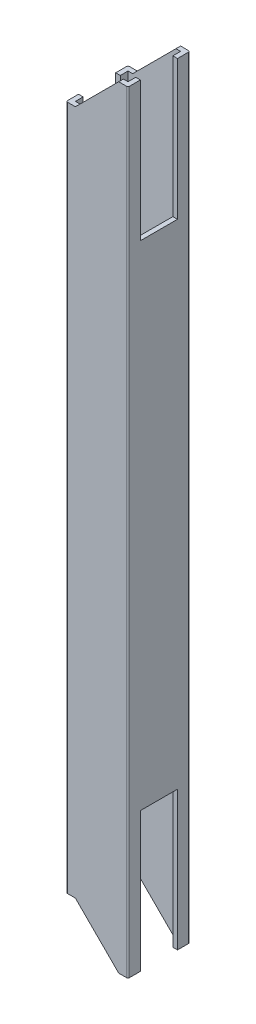
ISO-10303-21;
HEADER;
FILE_DESCRIPTION(('STEP AP214'),'2;1');
FILE_NAME('part.step','',(''),(''),'','','');
FILE_SCHEMA(('AUTOMOTIVE_DESIGN { 1 0 10303 214 1 1 1 1 }'));
ENDSEC;
DATA;
#1=APPLICATION_CONTEXT('core data for automotive mechanical design processes');
#2=APPLICATION_PROTOCOL_DEFINITION('international standard','automotive_design',2000,#1);
#3=PRODUCT_CONTEXT('',#1,'mechanical');
#4=PRODUCT('Part','Part','',(#3));
#5=PRODUCT_RELATED_PRODUCT_CATEGORY('part','',(#4));
#6=PRODUCT_DEFINITION_FORMATION('','',#4);
#7=PRODUCT_DEFINITION_CONTEXT('part definition',#1,'design');
#8=PRODUCT_DEFINITION('design','',#6,#7);
#9=PRODUCT_DEFINITION_SHAPE('','',#8);
#10=(LENGTH_UNIT() NAMED_UNIT(*) SI_UNIT(.MILLI.,.METRE.));
#11=(NAMED_UNIT(*) PLANE_ANGLE_UNIT() SI_UNIT($,.RADIAN.));
#12=(NAMED_UNIT(*) SI_UNIT($,.STERADIAN.) SOLID_ANGLE_UNIT());
#13=UNCERTAINTY_MEASURE_WITH_UNIT(LENGTH_MEASURE(1.E-05),#10,'distance_accuracy_value','');
#14=(GEOMETRIC_REPRESENTATION_CONTEXT(3) GLOBAL_UNCERTAINTY_ASSIGNED_CONTEXT((#13)) GLOBAL_UNIT_ASSIGNED_CONTEXT((#10,
#11,#12)) REPRESENTATION_CONTEXT('',''));
#15=CARTESIAN_POINT('',(0.,0.,0.));
#16=DIRECTION('',(0.,0.,1.));
#17=DIRECTION('',(1.,0.,0.));
#18=AXIS2_PLACEMENT_3D('',#15,#16,#17);
#19=CARTESIAN_POINT('',(19.5,249.5,-0.5));
#20=DIRECTION('',(0.,1.,0.));
#21=DIRECTION('',(0.,0.,1.));
#22=AXIS2_PLACEMENT_3D('',#19,#20,#21);
#23=PLANE('',#22);
#24=DIRECTION('',(0.,0.,-1.));
#25=VECTOR('',#24,1.);
#26=CARTESIAN_POINT('',(17.,249.5,0.));
#27=LINE('',#26,#25);
#28=CARTESIAN_POINT('',(17.,249.5,0.));
#29=VERTEX_POINT('',#28);
#30=CARTESIAN_POINT('',(17.,249.5,-1.5));
#31=VERTEX_POINT('',#30);
#32=EDGE_CURVE('E267',#29,#31,#27,.T.);
#33=ORIENTED_EDGE('',*,*,#32,.F.);
#34=DIRECTION('',(1.,0.,0.));
#35=VECTOR('',#34,1.);
#36=CARTESIAN_POINT('',(0.500000000000004,249.5,0.));
#37=LINE('',#36,#35);
#38=CARTESIAN_POINT('',(19.5,249.5,0.));
#39=VERTEX_POINT('',#38);
#40=EDGE_CURVE('E281',#29,#39,#37,.T.);
#41=ORIENTED_EDGE('',*,*,#40,.T.);
#42=CARTESIAN_POINT('',(19.5,249.5,-0.5));
#43=DIRECTION('',(0.,1.,0.));
#44=DIRECTION('',(0.,0.,1.));
#45=AXIS2_PLACEMENT_3D('',#42,#43,#44);
#46=CIRCLE('',#45,0.5);
#47=CARTESIAN_POINT('',(20.,249.5,-0.5));
#48=VERTEX_POINT('',#47);
#49=EDGE_CURVE('E315',#39,#48,#46,.T.);
#50=ORIENTED_EDGE('',*,*,#49,.T.);
#51=DIRECTION('',(0.,0.,-1.));
#52=VECTOR('',#51,1.);
#53=CARTESIAN_POINT('',(20.,249.5,-0.5));
#54=LINE('',#53,#52);
#55=CARTESIAN_POINT('',(20.,249.5,-4.00000000000007));
#56=VERTEX_POINT('',#55);
#57=EDGE_CURVE('E515',#48,#56,#54,.T.);
#58=ORIENTED_EDGE('',*,*,#57,.T.);
#59=DIRECTION('',(-1.,0.,0.));
#60=VECTOR('',#59,1.);
#61=CARTESIAN_POINT('',(20.,249.5,-4.00000000000007));
#62=LINE('',#61,#60);
#63=CARTESIAN_POINT('',(18.5,249.5,-4.00000000000007));
#64=VERTEX_POINT('',#63);
#65=EDGE_CURVE('E428',#56,#64,#62,.T.);
#66=ORIENTED_EDGE('',*,*,#65,.T.);
#67=DIRECTION('',(0.,0.,-1.));
#68=VECTOR('',#67,1.);
#69=CARTESIAN_POINT('',(18.5,249.5,-1.5));
#70=LINE('',#69,#68);
#71=CARTESIAN_POINT('',(18.5,249.5,-1.5));
#72=VERTEX_POINT('',#71);
#73=EDGE_CURVE('E492',#72,#64,#70,.T.);
#74=ORIENTED_EDGE('',*,*,#73,.F.);
#75=DIRECTION('',(1.,0.,0.));
#76=VECTOR('',#75,1.);
#77=CARTESIAN_POINT('',(1.5,249.5,-1.5));
#78=LINE('',#77,#76);
#79=EDGE_CURVE('E284',#31,#72,#78,.T.);
#80=ORIENTED_EDGE('',*,*,#79,.F.);
#81=EDGE_LOOP('',(#33,#41,#50,#58,#66,#74,#80));
#82=FACE_BOUND('',#81,.T.);
#83=ADVANCED_FACE('F33',(#82),#23,.T.);
#84=CARTESIAN_POINT('',(19.5,0.,-0.5));
#85=DIRECTION('',(0.,1.,0.));
#86=DIRECTION('',(0.,0.,1.));
#87=AXIS2_PLACEMENT_3D('',#84,#85,#86);
#88=PLANE('',#87);
#89=DIRECTION('',(-1.,0.,0.));
#90=VECTOR('',#89,1.);
#91=CARTESIAN_POINT('',(1.5,0.,-18.5));
#92=LINE('',#91,#90);
#93=CARTESIAN_POINT('',(18.5,0.,-18.5));
#94=VERTEX_POINT('',#93);
#95=CARTESIAN_POINT('',(17.,0.,-18.5));
#96=VERTEX_POINT('',#95);
#97=EDGE_CURVE('E491',#94,#96,#92,.T.);
#98=ORIENTED_EDGE('',*,*,#97,.T.);
#99=DIRECTION('',(0.,0.,-1.));
#100=VECTOR('',#99,1.);
#101=CARTESIAN_POINT('',(17.,0.,0.));
#102=LINE('',#101,#100);
#103=CARTESIAN_POINT('',(17.,0.,-20.));
#104=VERTEX_POINT('',#103);
#105=EDGE_CURVE('E360',#96,#104,#102,.T.);
#106=ORIENTED_EDGE('',*,*,#105,.T.);
#107=DIRECTION('',(-1.,0.,0.));
#108=VECTOR('',#107,1.);
#109=CARTESIAN_POINT('',(0.5,0.,-20.));
#110=LINE('',#109,#108);
#111=CARTESIAN_POINT('',(19.5,0.,-20.));
#112=VERTEX_POINT('',#111);
#113=EDGE_CURVE('E311',#112,#104,#110,.T.);
#114=ORIENTED_EDGE('',*,*,#113,.F.);
#115=CARTESIAN_POINT('',(19.5,0.,-19.5));
#116=DIRECTION('',(0.,1.,0.));
#117=DIRECTION('',(0.,0.,-1.));
#118=AXIS2_PLACEMENT_3D('',#115,#116,#117);
#119=CIRCLE('',#118,0.5);
#120=CARTESIAN_POINT('',(20.,0.,-19.5));
#121=VERTEX_POINT('',#120);
#122=EDGE_CURVE('E309',#121,#112,#119,.T.);
#123=ORIENTED_EDGE('',*,*,#122,.F.);
#124=DIRECTION('',(0.,0.,-1.));
#125=VECTOR('',#124,1.);
#126=CARTESIAN_POINT('',(20.,0.,-0.5));
#127=LINE('',#126,#125);
#128=CARTESIAN_POINT('',(20.,0.,-16.));
#129=VERTEX_POINT('',#128);
#130=EDGE_CURVE('E304',#129,#121,#127,.T.);
#131=ORIENTED_EDGE('',*,*,#130,.F.);
#132=DIRECTION('',(-1.,0.,0.));
#133=VECTOR('',#132,1.);
#134=CARTESIAN_POINT('',(20.,0.,-16.));
#135=LINE('',#134,#133);
#136=CARTESIAN_POINT('',(18.5,0.,-16.));
#137=VERTEX_POINT('',#136);
#138=EDGE_CURVE('E423',#129,#137,#135,.T.);
#139=ORIENTED_EDGE('',*,*,#138,.T.);
#140=DIRECTION('',(0.,0.,-1.));
#141=VECTOR('',#140,1.);
#142=CARTESIAN_POINT('',(18.5,0.,-1.5));
#143=LINE('',#142,#141);
#144=EDGE_CURVE('E499',#137,#94,#143,.T.);
#145=ORIENTED_EDGE('',*,*,#144,.T.);
#146=EDGE_LOOP('',(#98,#106,#114,#123,#131,#139,#145));
#147=FACE_BOUND('',#146,.T.);
#148=ADVANCED_FACE('F587',(#147),#88,.F.);
#149=CARTESIAN_POINT('',(17.,249.5,-18.5));
#150=VERTEX_POINT('',#149);
#151=CARTESIAN_POINT('',(17.,249.5,-20.));
#152=VERTEX_POINT('',#151);
#153=EDGE_CURVE('E286',#150,#152,#27,.T.);
#154=ORIENTED_EDGE('',*,*,#153,.F.);
#155=DIRECTION('',(-1.,0.,0.));
#156=VECTOR('',#155,1.);
#157=CARTESIAN_POINT('',(1.5,249.5,-18.5));
#158=LINE('',#157,#156);
#159=CARTESIAN_POINT('',(18.5,249.5,-18.5));
#160=VERTEX_POINT('',#159);
#161=EDGE_CURVE('E495',#160,#150,#158,.T.);
#162=ORIENTED_EDGE('',*,*,#161,.F.);
#163=CARTESIAN_POINT('',(18.5,249.5,-16.0000000000001));
#164=VERTEX_POINT('',#163);
#165=EDGE_CURVE('E490',#164,#160,#70,.T.);
#166=ORIENTED_EDGE('',*,*,#165,.F.);
#167=DIRECTION('',(-1.,0.,0.));
#168=VECTOR('',#167,1.);
#169=CARTESIAN_POINT('',(20.,249.5,-16.));
#170=LINE('',#169,#168);
#171=CARTESIAN_POINT('',(20.,249.5,-16.));
#172=VERTEX_POINT('',#171);
#173=EDGE_CURVE('E455',#172,#164,#170,.T.);
#174=ORIENTED_EDGE('',*,*,#173,.F.);
#175=CARTESIAN_POINT('',(20.,249.5,-19.5));
#176=VERTEX_POINT('',#175);
#177=EDGE_CURVE('E514',#172,#176,#54,.T.);
#178=ORIENTED_EDGE('',*,*,#177,.T.);
#179=CARTESIAN_POINT('',(19.5,249.5,-19.5));
#180=DIRECTION('',(0.,1.,0.));
#181=DIRECTION('',(0.,0.,-1.));
#182=AXIS2_PLACEMENT_3D('',#179,#180,#181);
#183=CIRCLE('',#182,0.5);
#184=CARTESIAN_POINT('',(19.5,249.5,-20.));
#185=VERTEX_POINT('',#184);
#186=EDGE_CURVE('E297',#176,#185,#183,.T.);
#187=ORIENTED_EDGE('',*,*,#186,.T.);
#188=DIRECTION('',(-1.,0.,0.));
#189=VECTOR('',#188,1.);
#190=CARTESIAN_POINT('',(0.5,249.5,-20.));
#191=LINE('',#190,#189);
#192=EDGE_CURVE('E292',#185,#152,#191,.T.);
#193=ORIENTED_EDGE('',*,*,#192,.T.);
#194=EDGE_LOOP('',(#154,#162,#166,#174,#178,#187,#193));
#195=FACE_BOUND('',#194,.T.);
#196=ADVANCED_FACE('F521',(#195),#23,.T.);
#197=DIRECTION('',(1.,0.,0.));
#198=VECTOR('',#197,1.);
#199=CARTESIAN_POINT('',(0.500000000000004,0.,0.));
#200=LINE('',#199,#198);
#201=CARTESIAN_POINT('',(17.,0.,0.));
#202=VERTEX_POINT('',#201);
#203=CARTESIAN_POINT('',(19.5,0.,0.));
#204=VERTEX_POINT('',#203);
#205=EDGE_CURVE('E314',#202,#204,#200,.T.);
#206=ORIENTED_EDGE('',*,*,#205,.F.);
#207=CARTESIAN_POINT('',(17.,0.,-1.5));
#208=VERTEX_POINT('',#207);
#209=EDGE_CURVE('E558',#202,#208,#102,.T.);
#210=ORIENTED_EDGE('',*,*,#209,.T.);
#211=DIRECTION('',(1.,0.,0.));
#212=VECTOR('',#211,1.);
#213=CARTESIAN_POINT('',(1.5,0.,-1.5));
#214=LINE('',#213,#212);
#215=CARTESIAN_POINT('',(18.5,0.,-1.5));
#216=VERTEX_POINT('',#215);
#217=EDGE_CURVE('E488',#208,#216,#214,.T.);
#218=ORIENTED_EDGE('',*,*,#217,.T.);
#219=CARTESIAN_POINT('',(18.5,0.,-4.));
#220=VERTEX_POINT('',#219);
#221=EDGE_CURVE('E500',#216,#220,#143,.T.);
#222=ORIENTED_EDGE('',*,*,#221,.T.);
#223=DIRECTION('',(-1.,0.,0.));
#224=VECTOR('',#223,1.);
#225=CARTESIAN_POINT('',(20.,0.,-4.));
#226=LINE('',#225,#224);
#227=CARTESIAN_POINT('',(20.,0.,-4.));
#228=VERTEX_POINT('',#227);
#229=EDGE_CURVE('E441',#228,#220,#226,.T.);
#230=ORIENTED_EDGE('',*,*,#229,.F.);
#231=CARTESIAN_POINT('',(20.,0.,-0.5));
#232=VERTEX_POINT('',#231);
#233=EDGE_CURVE('E306',#232,#228,#127,.T.);
#234=ORIENTED_EDGE('',*,*,#233,.F.);
#235=CARTESIAN_POINT('',(19.5,0.,-0.5));
#236=DIRECTION('',(0.,1.,0.));
#237=DIRECTION('',(0.,0.,1.));
#238=AXIS2_PLACEMENT_3D('',#235,#236,#237);
#239=CIRCLE('',#238,0.5);
#240=EDGE_CURVE('E301',#204,#232,#239,.T.);
#241=ORIENTED_EDGE('',*,*,#240,.F.);
#242=EDGE_LOOP('',(#206,#210,#218,#222,#230,#234,#241));
#243=FACE_BOUND('',#242,.T.);
#244=ADVANCED_FACE('F614',(#243),#88,.F.);
#245=CARTESIAN_POINT('',(19.5,249.5,-0.5));
#246=DIRECTION('',(0.,-1.,0.));
#247=DIRECTION('',(0.,0.,-1.));
#248=AXIS2_PLACEMENT_3D('',#245,#246,#247);
#249=CYLINDRICAL_SURFACE('',#248,0.5);
#250=ORIENTED_EDGE('',*,*,#240,.T.);
#251=DIRECTION('',(0.,-1.,0.));
#252=VECTOR('',#251,1.);
#253=CARTESIAN_POINT('',(20.,249.5,-0.5));
#254=LINE('',#253,#252);
#255=EDGE_CURVE('E334',#48,#232,#254,.T.);
#256=ORIENTED_EDGE('',*,*,#255,.F.);
#257=ORIENTED_EDGE('',*,*,#49,.F.);
#258=DIRECTION('',(0.,-1.,0.));
#259=VECTOR('',#258,1.);
#260=CARTESIAN_POINT('',(19.5,249.5,0.));
#261=LINE('',#260,#259);
#262=EDGE_CURVE('E290',#39,#204,#261,.T.);
#263=ORIENTED_EDGE('',*,*,#262,.T.);
#264=EDGE_LOOP('',(#250,#256,#257,#263));
#265=FACE_BOUND('',#264,.T.);
#266=ADVANCED_FACE('F35',(#265),#249,.T.);
#267=CARTESIAN_POINT('',(20.,249.5,-0.5));
#268=DIRECTION('',(-1.,0.,0.));
#269=DIRECTION('',(0.,0.,1.));
#270=AXIS2_PLACEMENT_3D('',#267,#268,#269);
#271=PLANE('',#270);
#272=DIRECTION('',(0.,0.,-1.));
#273=VECTOR('',#272,1.);
#274=CARTESIAN_POINT('',(20.,45.,-16.));
#275=LINE('',#274,#273);
#276=CARTESIAN_POINT('',(20.,45.,-3.99999999999995));
#277=VERTEX_POINT('',#276);
#278=CARTESIAN_POINT('',(20.,45.,-16.));
#279=VERTEX_POINT('',#278);
#280=EDGE_CURVE('E420',#277,#279,#275,.T.);
#281=ORIENTED_EDGE('',*,*,#280,.T.);
#282=DIRECTION('',(0.,-1.,0.));
#283=VECTOR('',#282,1.);
#284=CARTESIAN_POINT('',(20.,0.,-16.));
#285=LINE('',#284,#283);
#286=EDGE_CURVE('E413',#279,#129,#285,.T.);
#287=ORIENTED_EDGE('',*,*,#286,.T.);
#288=ORIENTED_EDGE('',*,*,#130,.T.);
#289=DIRECTION('',(0.,-1.,0.));
#290=VECTOR('',#289,1.);
#291=CARTESIAN_POINT('',(20.,249.5,-19.5));
#292=LINE('',#291,#290);
#293=EDGE_CURVE('E331',#176,#121,#292,.T.);
#294=ORIENTED_EDGE('',*,*,#293,.F.);
#295=ORIENTED_EDGE('',*,*,#177,.F.);
#296=DIRECTION('',(0.,-1.,0.));
#297=VECTOR('',#296,1.);
#298=CARTESIAN_POINT('',(20.,249.5,-16.));
#299=LINE('',#298,#297);
#300=CARTESIAN_POINT('',(20.,204.5,-16.0000000000001));
#301=VERTEX_POINT('',#300);
#302=EDGE_CURVE('E445',#172,#301,#299,.T.);
#303=ORIENTED_EDGE('',*,*,#302,.T.);
#304=DIRECTION('',(0.,0.,1.));
#305=VECTOR('',#304,1.);
#306=CARTESIAN_POINT('',(20.,204.5,-16.0000000000001));
#307=LINE('',#306,#305);
#308=CARTESIAN_POINT('',(20.,204.5,-3.99999999999997));
#309=VERTEX_POINT('',#308);
#310=EDGE_CURVE('E448',#301,#309,#307,.T.);
#311=ORIENTED_EDGE('',*,*,#310,.T.);
#312=DIRECTION('',(0.,1.,0.));
#313=VECTOR('',#312,1.);
#314=CARTESIAN_POINT('',(20.,249.5,-4.00000000000007));
#315=LINE('',#314,#313);
#316=EDGE_CURVE('E452',#309,#56,#315,.T.);
#317=ORIENTED_EDGE('',*,*,#316,.T.);
#318=ORIENTED_EDGE('',*,*,#57,.F.);
#319=ORIENTED_EDGE('',*,*,#255,.T.);
#320=ORIENTED_EDGE('',*,*,#233,.T.);
#321=DIRECTION('',(0.,1.,0.));
#322=VECTOR('',#321,1.);
#323=CARTESIAN_POINT('',(20.,0.,-4.));
#324=LINE('',#323,#322);
#325=EDGE_CURVE('E416',#228,#277,#324,.T.);
#326=ORIENTED_EDGE('',*,*,#325,.T.);
#327=EDGE_LOOP('',(#281,#287,#288,#294,#295,#303,#311,#317,#318,#319,#320,#326));
#328=FACE_BOUND('',#327,.T.);
#329=ADVANCED_FACE('F619',(#328),#271,.F.);
#330=CARTESIAN_POINT('',(19.5,249.5,-19.5));
#331=DIRECTION('',(0.,-1.,0.));
#332=DIRECTION('',(0.,0.,-1.));
#333=AXIS2_PLACEMENT_3D('',#330,#331,#332);
#334=CYLINDRICAL_SURFACE('',#333,0.5);
#335=ORIENTED_EDGE('',*,*,#122,.T.);
#336=DIRECTION('',(0.,-1.,0.));
#337=VECTOR('',#336,1.);
#338=CARTESIAN_POINT('',(19.5,249.5,-20.));
#339=LINE('',#338,#337);
#340=EDGE_CURVE('E328',#185,#112,#339,.T.);
#341=ORIENTED_EDGE('',*,*,#340,.F.);
#342=ORIENTED_EDGE('',*,*,#186,.F.);
#343=ORIENTED_EDGE('',*,*,#293,.T.);
#344=EDGE_LOOP('',(#335,#341,#342,#343));
#345=FACE_BOUND('',#344,.T.);
#346=ADVANCED_FACE('F527',(#345),#334,.T.);
#347=CARTESIAN_POINT('',(0.5,249.5,-20.));
#348=DIRECTION('',(0.,0.,1.));
#349=DIRECTION('',(1.,0.,0.));
#350=AXIS2_PLACEMENT_3D('',#347,#348,#349);
#351=PLANE('',#350);
#352=DIRECTION('',(0.,-1.,0.));
#353=VECTOR('',#352,1.);
#354=CARTESIAN_POINT('',(0.5,249.5,-20.));
#355=LINE('',#354,#353);
#356=CARTESIAN_POINT('',(0.5,235.5,-20.));
#357=VERTEX_POINT('',#356);
#358=CARTESIAN_POINT('',(0.5,14.,-20.));
#359=VERTEX_POINT('',#358);
#360=EDGE_CURVE('E325',#357,#359,#355,.T.);
#361=ORIENTED_EDGE('',*,*,#360,.F.);
#362=DIRECTION('',(-1.,0.,0.));
#363=VECTOR('',#362,1.);
#364=CARTESIAN_POINT('',(0.,235.5,-20.));
#365=LINE('',#364,#363);
#366=CARTESIAN_POINT('',(3.,235.5,-20.));
#367=VERTEX_POINT('',#366);
#368=EDGE_CURVE('E276',#367,#357,#365,.T.);
#369=ORIENTED_EDGE('',*,*,#368,.F.);
#370=DIRECTION('',(-0.707106781186546,-0.707106781186549,0.));
#371=VECTOR('',#370,1.);
#372=CARTESIAN_POINT('',(3.,235.5,-20.));
#373=LINE('',#372,#371);
#374=EDGE_CURVE('E536',#152,#367,#373,.T.);
#375=ORIENTED_EDGE('',*,*,#374,.F.);
#376=ORIENTED_EDGE('',*,*,#192,.F.);
#377=ORIENTED_EDGE('',*,*,#340,.T.);
#378=ORIENTED_EDGE('',*,*,#113,.T.);
#379=DIRECTION('',(0.707106781186547,-0.707106781186548,0.));
#380=VECTOR('',#379,1.);
#381=CARTESIAN_POINT('',(3.,14.,-20.));
#382=LINE('',#381,#380);
#383=CARTESIAN_POINT('',(3.,14.,-20.));
#384=VERTEX_POINT('',#383);
#385=EDGE_CURVE('E553',#384,#104,#382,.T.);
#386=ORIENTED_EDGE('',*,*,#385,.F.);
#387=DIRECTION('',(1.,0.,0.));
#388=VECTOR('',#387,1.);
#389=CARTESIAN_POINT('',(0.,14.,-20.));
#390=LINE('',#389,#388);
#391=EDGE_CURVE('E370',#359,#384,#390,.T.);
#392=ORIENTED_EDGE('',*,*,#391,.F.);
#393=EDGE_LOOP('',(#361,#369,#375,#376,#377,#378,#386,#392));
#394=FACE_BOUND('',#393,.T.);
#395=ADVANCED_FACE('F533',(#394),#351,.F.);
#396=CARTESIAN_POINT('',(0.5,249.5,-19.5));
#397=DIRECTION('',(0.,-1.,0.));
#398=DIRECTION('',(0.,0.,-1.));
#399=AXIS2_PLACEMENT_3D('',#396,#397,#398);
#400=CYLINDRICAL_SURFACE('',#399,0.5);
#401=DIRECTION('',(0.,-1.,0.));
#402=VECTOR('',#401,1.);
#403=CARTESIAN_POINT('',(0.,249.5,-19.5));
#404=LINE('',#403,#402);
#405=CARTESIAN_POINT('',(0.,235.5,-19.5));
#406=VERTEX_POINT('',#405);
#407=CARTESIAN_POINT('',(0.,14.,-19.5));
#408=VERTEX_POINT('',#407);
#409=EDGE_CURVE('E322',#406,#408,#404,.T.);
#410=ORIENTED_EDGE('',*,*,#409,.F.);
#411=CARTESIAN_POINT('',(0.5,235.5,-19.5));
#412=DIRECTION('',(0.,-1.,0.));
#413=DIRECTION('',(0.,0.,-1.));
#414=AXIS2_PLACEMENT_3D('',#411,#412,#413);
#415=CIRCLE('',#414,0.5);
#416=EDGE_CURVE('E405',#406,#357,#415,.T.);
#417=ORIENTED_EDGE('',*,*,#416,.T.);
#418=ORIENTED_EDGE('',*,*,#360,.T.);
#419=CARTESIAN_POINT('',(0.5,14.,-19.5));
#420=DIRECTION('',(0.,1.,0.));
#421=DIRECTION('',(0.,0.,1.));
#422=AXIS2_PLACEMENT_3D('',#419,#420,#421);
#423=CIRCLE('',#422,0.5);
#424=EDGE_CURVE('E384',#359,#408,#423,.T.);
#425=ORIENTED_EDGE('',*,*,#424,.T.);
#426=EDGE_LOOP('',(#410,#417,#418,#425));
#427=FACE_BOUND('',#426,.T.);
#428=ADVANCED_FACE('F585',(#427),#400,.T.);
#429=CARTESIAN_POINT('',(0.,249.5,-0.500000000000004));
#430=DIRECTION('',(1.,0.,0.));
#431=DIRECTION('',(0.,0.,-1.));
#432=AXIS2_PLACEMENT_3D('',#429,#430,#431);
#433=PLANE('',#432);
#434=DIRECTION('',(0.,-1.,0.));
#435=VECTOR('',#434,1.);
#436=CARTESIAN_POINT('',(0.,249.5,-0.500000000000003));
#437=LINE('',#436,#435);
#438=CARTESIAN_POINT('',(0.,235.5,-0.5));
#439=VERTEX_POINT('',#438);
#440=CARTESIAN_POINT('',(0.,14.,-0.5));
#441=VERTEX_POINT('',#440);
#442=EDGE_CURVE('E319',#439,#441,#437,.T.);
#443=ORIENTED_EDGE('',*,*,#442,.F.);
#444=DIRECTION('',(0.,0.,-1.));
#445=VECTOR('',#444,1.);
#446=CARTESIAN_POINT('',(0.,235.5,0.));
#447=LINE('',#446,#445);
#448=CARTESIAN_POINT('',(0.,235.5,-4.00000000000003));
#449=VERTEX_POINT('',#448);
#450=EDGE_CURVE('E545',#439,#449,#447,.T.);
#451=ORIENTED_EDGE('',*,*,#450,.T.);
#452=DIRECTION('',(0.,1.,0.));
#453=VECTOR('',#452,1.);
#454=CARTESIAN_POINT('',(0.,249.5,-4.00000000000007));
#455=LINE('',#454,#453);
#456=CARTESIAN_POINT('',(0.,204.5,-3.99999999999997));
#457=VERTEX_POINT('',#456);
#458=EDGE_CURVE('E449',#457,#449,#455,.T.);
#459=ORIENTED_EDGE('',*,*,#458,.F.);
#460=DIRECTION('',(0.,0.,1.));
#461=VECTOR('',#460,1.);
#462=CARTESIAN_POINT('',(0.,204.5,-16.0000000000001));
#463=LINE('',#462,#461);
#464=CARTESIAN_POINT('',(0.,204.5,-16.0000000000001));
#465=VERTEX_POINT('',#464);
#466=EDGE_CURVE('E457',#465,#457,#463,.T.);
#467=ORIENTED_EDGE('',*,*,#466,.F.);
#468=DIRECTION('',(0.,-1.,0.));
#469=VECTOR('',#468,1.);
#470=CARTESIAN_POINT('',(0.,249.5,-16.));
#471=LINE('',#470,#469);
#472=CARTESIAN_POINT('',(0.,235.5,-16.0000000000001));
#473=VERTEX_POINT('',#472);
#474=EDGE_CURVE('E412',#473,#465,#471,.T.);
#475=ORIENTED_EDGE('',*,*,#474,.F.);
#476=EDGE_CURVE('E56',#473,#406,#447,.T.);
#477=ORIENTED_EDGE('',*,*,#476,.T.);
#478=ORIENTED_EDGE('',*,*,#409,.T.);
#479=DIRECTION('',(0.,0.,-1.));
#480=VECTOR('',#479,1.);
#481=CARTESIAN_POINT('',(0.,14.,0.));
#482=LINE('',#481,#480);
#483=CARTESIAN_POINT('',(0.,14.,-16.));
#484=VERTEX_POINT('',#483);
#485=EDGE_CURVE('E556',#484,#408,#482,.T.);
#486=ORIENTED_EDGE('',*,*,#485,.F.);
#487=DIRECTION('',(0.,-1.,0.));
#488=VECTOR('',#487,1.);
#489=CARTESIAN_POINT('',(0.,0.,-16.));
#490=LINE('',#489,#488);
#491=CARTESIAN_POINT('',(0.,45.,-16.));
#492=VERTEX_POINT('',#491);
#493=EDGE_CURVE('E424',#492,#484,#490,.T.);
#494=ORIENTED_EDGE('',*,*,#493,.F.);
#495=DIRECTION('',(0.,0.,-1.));
#496=VECTOR('',#495,1.);
#497=CARTESIAN_POINT('',(0.,45.,-16.));
#498=LINE('',#497,#496);
#499=CARTESIAN_POINT('',(0.,45.,-3.99999999999995));
#500=VERTEX_POINT('',#499);
#501=EDGE_CURVE('E417',#500,#492,#498,.T.);
#502=ORIENTED_EDGE('',*,*,#501,.F.);
#503=DIRECTION('',(0.,1.,0.));
#504=VECTOR('',#503,1.);
#505=CARTESIAN_POINT('',(0.,0.,-4.));
#506=LINE('',#505,#504);
#507=CARTESIAN_POINT('',(0.,14.,-3.99999999999999));
#508=VERTEX_POINT('',#507);
#509=EDGE_CURVE('E427',#508,#500,#506,.T.);
#510=ORIENTED_EDGE('',*,*,#509,.F.);
#511=EDGE_CURVE('E373',#441,#508,#482,.T.);
#512=ORIENTED_EDGE('',*,*,#511,.F.);
#513=EDGE_LOOP('',(#443,#451,#459,#467,#475,#477,#478,#486,#494,#502,#510,#512));
#514=FACE_BOUND('',#513,.T.);
#515=ADVANCED_FACE('F582',(#514),#433,.F.);
#516=CARTESIAN_POINT('',(0.5,249.5,-0.5));
#517=DIRECTION('',(0.,-1.,0.));
#518=DIRECTION('',(0.,0.,-1.));
#519=AXIS2_PLACEMENT_3D('',#516,#517,#518);
#520=CYLINDRICAL_SURFACE('',#519,0.5);
#521=DIRECTION('',(0.,-1.,0.));
#522=VECTOR('',#521,1.);
#523=CARTESIAN_POINT('',(0.500000000000004,249.5,0.));
#524=LINE('',#523,#522);
#525=CARTESIAN_POINT('',(0.500000000000004,235.5,0.));
#526=VERTEX_POINT('',#525);
#527=CARTESIAN_POINT('',(0.500000000000004,14.,0.));
#528=VERTEX_POINT('',#527);
#529=EDGE_CURVE('E294',#526,#528,#524,.T.);
#530=ORIENTED_EDGE('',*,*,#529,.F.);
#531=CARTESIAN_POINT('',(0.5,235.5,-0.5));
#532=DIRECTION('',(0.,-1.,0.));
#533=DIRECTION('',(0.,0.,-1.));
#534=AXIS2_PLACEMENT_3D('',#531,#532,#533);
#535=CIRCLE('',#534,0.5);
#536=EDGE_CURVE('E402',#526,#439,#535,.T.);
#537=ORIENTED_EDGE('',*,*,#536,.T.);
#538=ORIENTED_EDGE('',*,*,#442,.T.);
#539=CARTESIAN_POINT('',(0.5,14.,-0.5));
#540=DIRECTION('',(0.,1.,0.));
#541=DIRECTION('',(0.,0.,1.));
#542=AXIS2_PLACEMENT_3D('',#539,#540,#541);
#543=CIRCLE('',#542,0.5);
#544=EDGE_CURVE('E380',#441,#528,#543,.T.);
#545=ORIENTED_EDGE('',*,*,#544,.T.);
#546=EDGE_LOOP('',(#530,#537,#538,#545));
#547=FACE_BOUND('',#546,.T.);
#548=ADVANCED_FACE('F596',(#547),#520,.T.);
#549=CARTESIAN_POINT('',(0.500000000000004,249.5,0.));
#550=DIRECTION('',(0.,0.,-1.));
#551=DIRECTION('',(-1.,0.,0.));
#552=AXIS2_PLACEMENT_3D('',#549,#550,#551);
#553=PLANE('',#552);
#554=DIRECTION('',(-0.707106781186546,-0.707106781186549,0.));
#555=VECTOR('',#554,1.);
#556=CARTESIAN_POINT('',(3.,235.5,0.));
#557=LINE('',#556,#555);
#558=CARTESIAN_POINT('',(3.,235.5,0.));
#559=VERTEX_POINT('',#558);
#560=EDGE_CURVE('E264',#29,#559,#557,.T.);
#561=ORIENTED_EDGE('',*,*,#560,.T.);
#562=DIRECTION('',(-1.,0.,0.));
#563=VECTOR('',#562,1.);
#564=CARTESIAN_POINT('',(0.,235.5,0.));
#565=LINE('',#564,#563);
#566=EDGE_CURVE('E275',#559,#526,#565,.T.);
#567=ORIENTED_EDGE('',*,*,#566,.T.);
#568=ORIENTED_EDGE('',*,*,#529,.T.);
#569=DIRECTION('',(1.,0.,0.));
#570=VECTOR('',#569,1.);
#571=CARTESIAN_POINT('',(0.,14.,0.));
#572=LINE('',#571,#570);
#573=CARTESIAN_POINT('',(3.,14.,0.));
#574=VERTEX_POINT('',#573);
#575=EDGE_CURVE('E550',#528,#574,#572,.T.);
#576=ORIENTED_EDGE('',*,*,#575,.T.);
#577=DIRECTION('',(0.707106781186547,-0.707106781186548,0.));
#578=VECTOR('',#577,1.);
#579=CARTESIAN_POINT('',(3.,14.,0.));
#580=LINE('',#579,#578);
#581=EDGE_CURVE('E547',#574,#202,#580,.T.);
#582=ORIENTED_EDGE('',*,*,#581,.T.);
#583=ORIENTED_EDGE('',*,*,#205,.T.);
#584=ORIENTED_EDGE('',*,*,#262,.F.);
#585=ORIENTED_EDGE('',*,*,#40,.F.);
#586=EDGE_LOOP('',(#561,#567,#568,#576,#582,#583,#584,#585));
#587=FACE_BOUND('',#586,.T.);
#588=ADVANCED_FACE('F288',(#587),#553,.F.);
#589=CARTESIAN_POINT('',(1.5,249.5,-1.5));
#590=DIRECTION('',(1.,0.,0.));
#591=DIRECTION('',(0.,0.,-1.));
#592=AXIS2_PLACEMENT_3D('',#589,#590,#591);
#593=PLANE('',#592);
#594=DIRECTION('',(0.,0.,-1.));
#595=VECTOR('',#594,1.);
#596=CARTESIAN_POINT('',(1.5,235.5,-1.5));
#597=LINE('',#596,#595);
#598=CARTESIAN_POINT('',(1.5,235.5,-1.5));
#599=VERTEX_POINT('',#598);
#600=CARTESIAN_POINT('',(1.5,235.5,-4.00000000000003));
#601=VERTEX_POINT('',#600);
#602=EDGE_CURVE('E48',#599,#601,#597,.T.);
#603=ORIENTED_EDGE('',*,*,#602,.F.);
#604=DIRECTION('',(0.,-1.,0.));
#605=VECTOR('',#604,1.);
#606=CARTESIAN_POINT('',(1.5,249.5,-1.5));
#607=LINE('',#606,#605);
#608=CARTESIAN_POINT('',(1.5,14.,-1.5));
#609=VERTEX_POINT('',#608);
#610=EDGE_CURVE('E305',#599,#609,#607,.T.);
#611=ORIENTED_EDGE('',*,*,#610,.T.);
#612=DIRECTION('',(0.,0.,1.));
#613=VECTOR('',#612,1.);
#614=CARTESIAN_POINT('',(1.5,14.,-1.5));
#615=LINE('',#614,#613);
#616=CARTESIAN_POINT('',(1.5,14.,-3.99999999999999));
#617=VERTEX_POINT('',#616);
#618=EDGE_CURVE('E388',#617,#609,#615,.T.);
#619=ORIENTED_EDGE('',*,*,#618,.F.);
#620=DIRECTION('',(0.,-1.,0.));
#621=VECTOR('',#620,1.);
#622=CARTESIAN_POINT('',(1.5,249.5,-3.99999999999969));
#623=LINE('',#622,#621);
#624=CARTESIAN_POINT('',(1.5,45.,-3.99999999999995));
#625=VERTEX_POINT('',#624);
#626=EDGE_CURVE('E480',#625,#617,#623,.T.);
#627=ORIENTED_EDGE('',*,*,#626,.F.);
#628=DIRECTION('',(0.,0.,1.));
#629=VECTOR('',#628,1.);
#630=CARTESIAN_POINT('',(1.5,45.,-1.49999999999988));
#631=LINE('',#630,#629);
#632=CARTESIAN_POINT('',(1.5,45.,-16.));
#633=VERTEX_POINT('',#632);
#634=EDGE_CURVE('E483',#633,#625,#631,.T.);
#635=ORIENTED_EDGE('',*,*,#634,.F.);
#636=DIRECTION('',(0.,1.,0.));
#637=VECTOR('',#636,1.);
#638=CARTESIAN_POINT('',(1.5,249.5,-16.));
#639=LINE('',#638,#637);
#640=CARTESIAN_POINT('',(1.5,14.,-16.));
#641=VERTEX_POINT('',#640);
#642=EDGE_CURVE('E486',#641,#633,#639,.T.);
#643=ORIENTED_EDGE('',*,*,#642,.F.);
#644=CARTESIAN_POINT('',(1.5,14.,-18.5));
#645=VERTEX_POINT('',#644);
#646=EDGE_CURVE('E381',#645,#641,#615,.T.);
#647=ORIENTED_EDGE('',*,*,#646,.F.);
#648=DIRECTION('',(0.,-1.,0.));
#649=VECTOR('',#648,1.);
#650=CARTESIAN_POINT('',(1.5,249.5,-18.5));
#651=LINE('',#650,#649);
#652=CARTESIAN_POINT('',(1.5,235.5,-18.5));
#653=VERTEX_POINT('',#652);
#654=EDGE_CURVE('E379',#653,#645,#651,.T.);
#655=ORIENTED_EDGE('',*,*,#654,.F.);
#656=CARTESIAN_POINT('',(1.5,235.5,-16.0000000000001));
#657=VERTEX_POINT('',#656);
#658=EDGE_CURVE('E394',#657,#653,#597,.T.);
#659=ORIENTED_EDGE('',*,*,#658,.F.);
#660=DIRECTION('',(0.,1.,0.));
#661=VECTOR('',#660,1.);
#662=CARTESIAN_POINT('',(1.5,249.5,-16.));
#663=LINE('',#662,#661);
#664=CARTESIAN_POINT('',(1.5,204.5,-16.0000000000001));
#665=VERTEX_POINT('',#664);
#666=EDGE_CURVE('E435',#665,#657,#663,.T.);
#667=ORIENTED_EDGE('',*,*,#666,.F.);
#668=DIRECTION('',(0.,0.,-1.));
#669=VECTOR('',#668,1.);
#670=CARTESIAN_POINT('',(1.5,204.5,-1.5));
#671=LINE('',#670,#669);
#672=CARTESIAN_POINT('',(1.5,204.5,-3.99999999999997));
#673=VERTEX_POINT('',#672);
#674=EDGE_CURVE('E475',#673,#665,#671,.T.);
#675=ORIENTED_EDGE('',*,*,#674,.F.);
#676=DIRECTION('',(0.,-1.,0.));
#677=VECTOR('',#676,1.);
#678=CARTESIAN_POINT('',(1.5,249.5,-4.00000000000007));
#679=LINE('',#678,#677);
#680=EDGE_CURVE('E478',#601,#673,#679,.T.);
#681=ORIENTED_EDGE('',*,*,#680,.F.);
#682=EDGE_LOOP('',(#603,#611,#619,#627,#635,#643,#647,#655,#659,#667,#675,#681));
#683=FACE_BOUND('',#682,.T.);
#684=ADVANCED_FACE('F572',(#683),#593,.T.);
#685=CARTESIAN_POINT('',(1.5,249.5,-1.5));
#686=DIRECTION('',(0.,0.,-1.));
#687=DIRECTION('',(-1.,0.,0.));
#688=AXIS2_PLACEMENT_3D('',#685,#686,#687);
#689=PLANE('',#688);
#690=DIRECTION('',(-1.,0.,0.));
#691=VECTOR('',#690,1.);
#692=CARTESIAN_POINT('',(1.5,235.5,-1.5));
#693=LINE('',#692,#691);
#694=CARTESIAN_POINT('',(3.,235.5,-1.5));
#695=VERTEX_POINT('',#694);
#696=EDGE_CURVE('E400',#695,#599,#693,.T.);
#697=ORIENTED_EDGE('',*,*,#696,.F.);
#698=DIRECTION('',(-0.707106781186546,-0.707106781186549,0.));
#699=VECTOR('',#698,1.);
#700=CARTESIAN_POINT('',(9.25000000000004,241.75,-1.5));
#701=LINE('',#700,#699);
#702=EDGE_CURVE('E410',#31,#695,#701,.T.);
#703=ORIENTED_EDGE('',*,*,#702,.F.);
#704=ORIENTED_EDGE('',*,*,#79,.T.);
#705=DIRECTION('',(0.,-1.,0.));
#706=VECTOR('',#705,1.);
#707=CARTESIAN_POINT('',(18.5,249.5,-1.5));
#708=LINE('',#707,#706);
#709=EDGE_CURVE('E508',#72,#216,#708,.T.);
#710=ORIENTED_EDGE('',*,*,#709,.T.);
#711=ORIENTED_EDGE('',*,*,#217,.F.);
#712=DIRECTION('',(0.707106781186547,-0.707106781186548,0.));
#713=VECTOR('',#712,1.);
#714=CARTESIAN_POINT('',(-115.5,132.5,-1.5));
#715=LINE('',#714,#713);
#716=CARTESIAN_POINT('',(3.,14.,-1.5));
#717=VERTEX_POINT('',#716);
#718=EDGE_CURVE('E408',#717,#208,#715,.T.);
#719=ORIENTED_EDGE('',*,*,#718,.F.);
#720=DIRECTION('',(1.,0.,0.));
#721=VECTOR('',#720,1.);
#722=CARTESIAN_POINT('',(1.5,14.,-1.5));
#723=LINE('',#722,#721);
#724=EDGE_CURVE('E560',#609,#717,#723,.T.);
#725=ORIENTED_EDGE('',*,*,#724,.F.);
#726=ORIENTED_EDGE('',*,*,#610,.F.);
#727=EDGE_LOOP('',(#697,#703,#704,#710,#711,#719,#725,#726));
#728=FACE_BOUND('',#727,.T.);
#729=ADVANCED_FACE('F606',(#728),#689,.T.);
#730=CARTESIAN_POINT('',(18.5,249.5,-1.5));
#731=DIRECTION('',(-1.,0.,0.));
#732=DIRECTION('',(0.,0.,1.));
#733=AXIS2_PLACEMENT_3D('',#730,#731,#732);
#734=PLANE('',#733);
#735=DIRECTION('',(0.,-1.,0.));
#736=VECTOR('',#735,1.);
#737=CARTESIAN_POINT('',(18.5,249.5,-16.));
#738=LINE('',#737,#736);
#739=CARTESIAN_POINT('',(18.5,45.,-16.));
#740=VERTEX_POINT('',#739);
#741=EDGE_CURVE('E347',#740,#137,#738,.T.);
#742=ORIENTED_EDGE('',*,*,#741,.F.);
#743=DIRECTION('',(0.,0.,-1.));
#744=VECTOR('',#743,1.);
#745=CARTESIAN_POINT('',(18.5,45.,-1.49999999999988));
#746=LINE('',#745,#744);
#747=CARTESIAN_POINT('',(18.5,45.,-3.99999999999995));
#748=VERTEX_POINT('',#747);
#749=EDGE_CURVE('E345',#748,#740,#746,.T.);
#750=ORIENTED_EDGE('',*,*,#749,.F.);
#751=DIRECTION('',(0.,1.,0.));
#752=VECTOR('',#751,1.);
#753=CARTESIAN_POINT('',(18.5,249.5,-3.99999999999969));
#754=LINE('',#753,#752);
#755=EDGE_CURVE('E343',#220,#748,#754,.T.);
#756=ORIENTED_EDGE('',*,*,#755,.F.);
#757=ORIENTED_EDGE('',*,*,#221,.F.);
#758=ORIENTED_EDGE('',*,*,#709,.F.);
#759=ORIENTED_EDGE('',*,*,#73,.T.);
#760=DIRECTION('',(0.,1.,0.));
#761=VECTOR('',#760,1.);
#762=CARTESIAN_POINT('',(18.5,249.5,-4.00000000000007));
#763=LINE('',#762,#761);
#764=CARTESIAN_POINT('',(18.5,204.5,-3.99999999999997));
#765=VERTEX_POINT('',#764);
#766=EDGE_CURVE('E341',#765,#64,#763,.T.);
#767=ORIENTED_EDGE('',*,*,#766,.F.);
#768=DIRECTION('',(0.,0.,1.));
#769=VECTOR('',#768,1.);
#770=CARTESIAN_POINT('',(18.5,204.5,-1.5));
#771=LINE('',#770,#769);
#772=CARTESIAN_POINT('',(18.5,204.5,-16.0000000000001));
#773=VERTEX_POINT('',#772);
#774=EDGE_CURVE('E339',#773,#765,#771,.T.);
#775=ORIENTED_EDGE('',*,*,#774,.F.);
#776=DIRECTION('',(0.,-1.,0.));
#777=VECTOR('',#776,1.);
#778=CARTESIAN_POINT('',(18.5,249.5,-16.));
#779=LINE('',#778,#777);
#780=EDGE_CURVE('E337',#164,#773,#779,.T.);
#781=ORIENTED_EDGE('',*,*,#780,.F.);
#782=ORIENTED_EDGE('',*,*,#165,.T.);
#783=DIRECTION('',(0.,-1.,0.));
#784=VECTOR('',#783,1.);
#785=CARTESIAN_POINT('',(18.5,249.5,-18.5));
#786=LINE('',#785,#784);
#787=EDGE_CURVE('E505',#160,#94,#786,.T.);
#788=ORIENTED_EDGE('',*,*,#787,.T.);
#789=ORIENTED_EDGE('',*,*,#144,.F.);
#790=EDGE_LOOP('',(#742,#750,#756,#757,#758,#759,#767,#775,#781,#782,#788,#789));
#791=FACE_BOUND('',#790,.T.);
#792=ADVANCED_FACE('F627',(#791),#734,.T.);
#793=CARTESIAN_POINT('',(1.5,249.5,-18.5));
#794=DIRECTION('',(0.,0.,1.));
#795=DIRECTION('',(1.,0.,0.));
#796=AXIS2_PLACEMENT_3D('',#793,#794,#795);
#797=PLANE('',#796);
#798=DIRECTION('',(1.,0.,0.));
#799=VECTOR('',#798,1.);
#800=CARTESIAN_POINT('',(1.5,235.5,-18.5));
#801=LINE('',#800,#799);
#802=CARTESIAN_POINT('',(3.,235.5,-18.5));
#803=VERTEX_POINT('',#802);
#804=EDGE_CURVE('E396',#653,#803,#801,.T.);
#805=ORIENTED_EDGE('',*,*,#804,.F.);
#806=ORIENTED_EDGE('',*,*,#654,.T.);
#807=DIRECTION('',(-1.,0.,0.));
#808=VECTOR('',#807,1.);
#809=CARTESIAN_POINT('',(1.5,14.,-18.5));
#810=LINE('',#809,#808);
#811=CARTESIAN_POINT('',(3.,14.,-18.5));
#812=VERTEX_POINT('',#811);
#813=EDGE_CURVE('E367',#812,#645,#810,.T.);
#814=ORIENTED_EDGE('',*,*,#813,.F.);
#815=DIRECTION('',(-0.707106781186547,0.707106781186548,0.));
#816=VECTOR('',#815,1.);
#817=CARTESIAN_POINT('',(-115.5,132.5,-18.5));
#818=LINE('',#817,#816);
#819=EDGE_CURVE('E41',#96,#812,#818,.T.);
#820=ORIENTED_EDGE('',*,*,#819,.F.);
#821=ORIENTED_EDGE('',*,*,#97,.F.);
#822=ORIENTED_EDGE('',*,*,#787,.F.);
#823=ORIENTED_EDGE('',*,*,#161,.T.);
#824=DIRECTION('',(0.707106781186546,0.707106781186549,0.));
#825=VECTOR('',#824,1.);
#826=CARTESIAN_POINT('',(9.25000000000004,241.75,-18.5));
#827=LINE('',#826,#825);
#828=EDGE_CURVE('E11',#803,#150,#827,.T.);
#829=ORIENTED_EDGE('',*,*,#828,.F.);
#830=EDGE_LOOP('',(#805,#806,#814,#820,#821,#822,#823,#829));
#831=FACE_BOUND('',#830,.T.);
#832=ADVANCED_FACE('F377',(#831),#797,.T.);
#833=CARTESIAN_POINT('',(20.,249.5,-16.));
#834=DIRECTION('',(0.,0.,-1.));
#835=DIRECTION('',(0.,1.,0.));
#836=AXIS2_PLACEMENT_3D('',#833,#834,#835);
#837=PLANE('',#836);
#838=ORIENTED_EDGE('',*,*,#780,.T.);
#839=DIRECTION('',(-1.,0.,0.));
#840=VECTOR('',#839,1.);
#841=CARTESIAN_POINT('',(20.,204.5,-16.0000000000001));
#842=LINE('',#841,#840);
#843=EDGE_CURVE('E468',#301,#773,#842,.T.);
#844=ORIENTED_EDGE('',*,*,#843,.F.);
#845=ORIENTED_EDGE('',*,*,#302,.F.);
#846=ORIENTED_EDGE('',*,*,#173,.T.);
#847=EDGE_LOOP('',(#838,#844,#845,#846));
#848=FACE_BOUND('',#847,.T.);
#849=ADVANCED_FACE('F721',(#848),#837,.F.);
#850=CARTESIAN_POINT('',(20.,204.5,-16.0000000000001));
#851=DIRECTION('',(0.,-1.,0.));
#852=DIRECTION('',(0.,0.,-1.));
#853=AXIS2_PLACEMENT_3D('',#850,#851,#852);
#854=PLANE('',#853);
#855=ORIENTED_EDGE('',*,*,#774,.T.);
#856=DIRECTION('',(-1.,0.,0.));
#857=VECTOR('',#856,1.);
#858=CARTESIAN_POINT('',(20.,204.5,-3.99999999999997));
#859=LINE('',#858,#857);
#860=EDGE_CURVE('E464',#309,#765,#859,.T.);
#861=ORIENTED_EDGE('',*,*,#860,.F.);
#862=ORIENTED_EDGE('',*,*,#310,.F.);
#863=ORIENTED_EDGE('',*,*,#843,.T.);
#864=EDGE_LOOP('',(#855,#861,#862,#863));
#865=FACE_BOUND('',#864,.T.);
#866=ADVANCED_FACE('F728',(#865),#854,.F.);
#867=CARTESIAN_POINT('',(20.,249.5,-4.00000000000007));
#868=DIRECTION('',(0.,0.,1.));
#869=DIRECTION('',(0.,-1.,0.));
#870=AXIS2_PLACEMENT_3D('',#867,#868,#869);
#871=PLANE('',#870);
#872=ORIENTED_EDGE('',*,*,#766,.T.);
#873=ORIENTED_EDGE('',*,*,#65,.F.);
#874=ORIENTED_EDGE('',*,*,#316,.F.);
#875=ORIENTED_EDGE('',*,*,#860,.T.);
#876=EDGE_LOOP('',(#872,#873,#874,#875));
#877=FACE_BOUND('',#876,.T.);
#878=ADVANCED_FACE('F623',(#877),#871,.F.);
#879=CARTESIAN_POINT('',(20.,0.,-4.));
#880=DIRECTION('',(0.,0.,1.));
#881=DIRECTION('',(0.,-1.,0.));
#882=AXIS2_PLACEMENT_3D('',#879,#880,#881);
#883=PLANE('',#882);
#884=ORIENTED_EDGE('',*,*,#755,.T.);
#885=DIRECTION('',(-1.,0.,0.));
#886=VECTOR('',#885,1.);
#887=CARTESIAN_POINT('',(20.,45.,-3.99999999999995));
#888=LINE('',#887,#886);
#889=EDGE_CURVE('E437',#277,#748,#888,.T.);
#890=ORIENTED_EDGE('',*,*,#889,.F.);
#891=ORIENTED_EDGE('',*,*,#325,.F.);
#892=ORIENTED_EDGE('',*,*,#229,.T.);
#893=EDGE_LOOP('',(#884,#890,#891,#892));
#894=FACE_BOUND('',#893,.T.);
#895=ADVANCED_FACE('F745',(#894),#883,.F.);
#896=CARTESIAN_POINT('',(20.,45.,-16.));
#897=DIRECTION('',(0.,1.,0.));
#898=DIRECTION('',(0.,0.,1.));
#899=AXIS2_PLACEMENT_3D('',#896,#897,#898);
#900=PLANE('',#899);
#901=ORIENTED_EDGE('',*,*,#749,.T.);
#902=DIRECTION('',(-1.,0.,0.));
#903=VECTOR('',#902,1.);
#904=CARTESIAN_POINT('',(20.,45.,-16.));
#905=LINE('',#904,#903);
#906=EDGE_CURVE('E432',#279,#740,#905,.T.);
#907=ORIENTED_EDGE('',*,*,#906,.F.);
#908=ORIENTED_EDGE('',*,*,#280,.F.);
#909=ORIENTED_EDGE('',*,*,#889,.T.);
#910=EDGE_LOOP('',(#901,#907,#908,#909));
#911=FACE_BOUND('',#910,.T.);
#912=ADVANCED_FACE('F753',(#911),#900,.F.);
#913=CARTESIAN_POINT('',(20.,0.,-16.));
#914=DIRECTION('',(0.,0.,-1.));
#915=DIRECTION('',(-1.,0.,0.));
#916=AXIS2_PLACEMENT_3D('',#913,#914,#915);
#917=PLANE('',#916);
#918=ORIENTED_EDGE('',*,*,#741,.T.);
#919=ORIENTED_EDGE('',*,*,#138,.F.);
#920=ORIENTED_EDGE('',*,*,#286,.F.);
#921=ORIENTED_EDGE('',*,*,#906,.T.);
#922=EDGE_LOOP('',(#918,#919,#920,#921));
#923=FACE_BOUND('',#922,.T.);
#924=ADVANCED_FACE('F761',(#923),#917,.F.);
#925=ORIENTED_EDGE('',*,*,#458,.T.);
#926=DIRECTION('',(1.,0.,0.));
#927=VECTOR('',#926,1.);
#928=CARTESIAN_POINT('',(20.,235.5,-4.00000000000003));
#929=LINE('',#928,#927);
#930=EDGE_CURVE('E398',#449,#601,#929,.T.);
#931=ORIENTED_EDGE('',*,*,#930,.T.);
#932=ORIENTED_EDGE('',*,*,#680,.T.);
#933=EDGE_CURVE('E467',#673,#457,#859,.T.);
#934=ORIENTED_EDGE('',*,*,#933,.T.);
#935=EDGE_LOOP('',(#925,#931,#932,#934));
#936=FACE_BOUND('',#935,.T.);
#937=ADVANCED_FACE('F747',(#936),#871,.F.);
#938=ORIENTED_EDGE('',*,*,#674,.T.);
#939=EDGE_CURVE('E471',#665,#465,#842,.T.);
#940=ORIENTED_EDGE('',*,*,#939,.T.);
#941=ORIENTED_EDGE('',*,*,#466,.T.);
#942=ORIENTED_EDGE('',*,*,#933,.F.);
#943=EDGE_LOOP('',(#938,#940,#941,#942));
#944=FACE_BOUND('',#943,.T.);
#945=ADVANCED_FACE('F739',(#944),#854,.F.);
#946=ORIENTED_EDGE('',*,*,#666,.T.);
#947=DIRECTION('',(-1.,0.,0.));
#948=VECTOR('',#947,1.);
#949=CARTESIAN_POINT('',(20.,235.5,-16.0000000000001));
#950=LINE('',#949,#948);
#951=EDGE_CURVE('E352',#657,#473,#950,.T.);
#952=ORIENTED_EDGE('',*,*,#951,.T.);
#953=ORIENTED_EDGE('',*,*,#474,.T.);
#954=ORIENTED_EDGE('',*,*,#939,.F.);
#955=EDGE_LOOP('',(#946,#952,#953,#954));
#956=FACE_BOUND('',#955,.T.);
#957=ADVANCED_FACE('F731',(#956),#837,.F.);
#958=ORIENTED_EDGE('',*,*,#493,.T.);
#959=DIRECTION('',(1.,0.,0.));
#960=VECTOR('',#959,1.);
#961=CARTESIAN_POINT('',(20.,14.,-16.));
#962=LINE('',#961,#960);
#963=EDGE_CURVE('E386',#484,#641,#962,.T.);
#964=ORIENTED_EDGE('',*,*,#963,.T.);
#965=ORIENTED_EDGE('',*,*,#642,.T.);
#966=EDGE_CURVE('E436',#633,#492,#905,.T.);
#967=ORIENTED_EDGE('',*,*,#966,.T.);
#968=EDGE_LOOP('',(#958,#964,#965,#967));
#969=FACE_BOUND('',#968,.T.);
#970=ADVANCED_FACE('F566',(#969),#917,.F.);
#971=ORIENTED_EDGE('',*,*,#634,.T.);
#972=EDGE_CURVE('E440',#625,#500,#888,.T.);
#973=ORIENTED_EDGE('',*,*,#972,.T.);
#974=ORIENTED_EDGE('',*,*,#501,.T.);
#975=ORIENTED_EDGE('',*,*,#966,.F.);
#976=EDGE_LOOP('',(#971,#973,#974,#975));
#977=FACE_BOUND('',#976,.T.);
#978=ADVANCED_FACE('F577',(#977),#900,.F.);
#979=ORIENTED_EDGE('',*,*,#626,.T.);
#980=DIRECTION('',(-1.,0.,0.));
#981=VECTOR('',#980,1.);
#982=CARTESIAN_POINT('',(20.,14.,-3.99999999999999));
#983=LINE('',#982,#981);
#984=EDGE_CURVE('E349',#617,#508,#983,.T.);
#985=ORIENTED_EDGE('',*,*,#984,.T.);
#986=ORIENTED_EDGE('',*,*,#509,.T.);
#987=ORIENTED_EDGE('',*,*,#972,.F.);
#988=EDGE_LOOP('',(#979,#985,#986,#987));
#989=FACE_BOUND('',#988,.T.);
#990=ADVANCED_FACE('F601',(#989),#883,.F.);
#991=CARTESIAN_POINT('',(0.,14.,0.));
#992=DIRECTION('',(0.,1.,0.));
#993=DIRECTION('',(0.,0.,1.));
#994=AXIS2_PLACEMENT_3D('',#991,#992,#993);
#995=PLANE('',#994);
#996=ORIENTED_EDGE('',*,*,#511,.T.);
#997=ORIENTED_EDGE('',*,*,#984,.F.);
#998=ORIENTED_EDGE('',*,*,#618,.T.);
#999=ORIENTED_EDGE('',*,*,#724,.T.);
#1000=DIRECTION('',(0.,0.,-1.));
#1001=VECTOR('',#1000,1.);
#1002=CARTESIAN_POINT('',(3.,14.,0.));
#1003=LINE('',#1002,#1001);
#1004=EDGE_CURVE('E372',#574,#717,#1003,.T.);
#1005=ORIENTED_EDGE('',*,*,#1004,.F.);
#1006=ORIENTED_EDGE('',*,*,#575,.F.);
#1007=ORIENTED_EDGE('',*,*,#544,.F.);
#1008=EDGE_LOOP('',(#996,#997,#998,#999,#1005,#1006,#1007));
#1009=FACE_BOUND('',#1008,.T.);
#1010=ADVANCED_FACE('F598',(#1009),#995,.F.);
#1011=CARTESIAN_POINT('',(3.,14.,0.));
#1012=DIRECTION('',(0.707106781186548,0.707106781186547,0.));
#1013=DIRECTION('',(-0.707106781186547,0.707106781186548,0.));
#1014=AXIS2_PLACEMENT_3D('',#1011,#1012,#1013);
#1015=PLANE('',#1014);
#1016=ORIENTED_EDGE('',*,*,#718,.T.);
#1017=ORIENTED_EDGE('',*,*,#209,.F.);
#1018=ORIENTED_EDGE('',*,*,#581,.F.);
#1019=ORIENTED_EDGE('',*,*,#1004,.T.);
#1020=EDGE_LOOP('',(#1016,#1017,#1018,#1019));
#1021=FACE_BOUND('',#1020,.T.);
#1022=ADVANCED_FACE('F610',(#1021),#1015,.F.);
#1023=ORIENTED_EDGE('',*,*,#391,.T.);
#1024=EDGE_CURVE('E357',#812,#384,#1003,.T.);
#1025=ORIENTED_EDGE('',*,*,#1024,.F.);
#1026=ORIENTED_EDGE('',*,*,#813,.T.);
#1027=ORIENTED_EDGE('',*,*,#646,.T.);
#1028=ORIENTED_EDGE('',*,*,#963,.F.);
#1029=ORIENTED_EDGE('',*,*,#485,.T.);
#1030=ORIENTED_EDGE('',*,*,#424,.F.);
#1031=EDGE_LOOP('',(#1023,#1025,#1026,#1027,#1028,#1029,#1030));
#1032=FACE_BOUND('',#1031,.T.);
#1033=ADVANCED_FACE('F366',(#1032),#995,.F.);
#1034=ORIENTED_EDGE('',*,*,#819,.T.);
#1035=ORIENTED_EDGE('',*,*,#1024,.T.);
#1036=ORIENTED_EDGE('',*,*,#385,.T.);
#1037=ORIENTED_EDGE('',*,*,#105,.F.);
#1038=EDGE_LOOP('',(#1034,#1035,#1036,#1037));
#1039=FACE_BOUND('',#1038,.T.);
#1040=ADVANCED_FACE('F356',(#1039),#1015,.F.);
#1041=CARTESIAN_POINT('',(0.,235.5,0.));
#1042=DIRECTION('',(0.,-1.,0.));
#1043=DIRECTION('',(0.,0.,-1.));
#1044=AXIS2_PLACEMENT_3D('',#1041,#1042,#1043);
#1045=PLANE('',#1044);
#1046=ORIENTED_EDGE('',*,*,#476,.F.);
#1047=ORIENTED_EDGE('',*,*,#951,.F.);
#1048=ORIENTED_EDGE('',*,*,#658,.T.);
#1049=ORIENTED_EDGE('',*,*,#804,.T.);
#1050=DIRECTION('',(0.,0.,-1.));
#1051=VECTOR('',#1050,1.);
#1052=CARTESIAN_POINT('',(3.,235.5,0.));
#1053=LINE('',#1052,#1051);
#1054=EDGE_CURVE('E285',#803,#367,#1053,.T.);
#1055=ORIENTED_EDGE('',*,*,#1054,.T.);
#1056=ORIENTED_EDGE('',*,*,#368,.T.);
#1057=ORIENTED_EDGE('',*,*,#416,.F.);
#1058=EDGE_LOOP('',(#1046,#1047,#1048,#1049,#1055,#1056,#1057));
#1059=FACE_BOUND('',#1058,.T.);
#1060=ADVANCED_FACE('F635',(#1059),#1045,.F.);
#1061=CARTESIAN_POINT('',(3.,235.5,0.));
#1062=DIRECTION('',(0.707106781186549,-0.707106781186546,0.));
#1063=DIRECTION('',(0.707106781186546,0.707106781186549,0.));
#1064=AXIS2_PLACEMENT_3D('',#1061,#1062,#1063);
#1065=PLANE('',#1064);
#1066=ORIENTED_EDGE('',*,*,#828,.T.);
#1067=ORIENTED_EDGE('',*,*,#153,.T.);
#1068=ORIENTED_EDGE('',*,*,#374,.T.);
#1069=ORIENTED_EDGE('',*,*,#1054,.F.);
#1070=EDGE_LOOP('',(#1066,#1067,#1068,#1069));
#1071=FACE_BOUND('',#1070,.T.);
#1072=ADVANCED_FACE('F639',(#1071),#1065,.F.);
#1073=ORIENTED_EDGE('',*,*,#702,.T.);
#1074=EDGE_CURVE('E270',#559,#695,#1053,.T.);
#1075=ORIENTED_EDGE('',*,*,#1074,.F.);
#1076=ORIENTED_EDGE('',*,*,#560,.F.);
#1077=ORIENTED_EDGE('',*,*,#32,.T.);
#1078=EDGE_LOOP('',(#1073,#1075,#1076,#1077));
#1079=FACE_BOUND('',#1078,.T.);
#1080=ADVANCED_FACE('F266',(#1079),#1065,.F.);
#1081=ORIENTED_EDGE('',*,*,#566,.F.);
#1082=ORIENTED_EDGE('',*,*,#1074,.T.);
#1083=ORIENTED_EDGE('',*,*,#696,.T.);
#1084=ORIENTED_EDGE('',*,*,#602,.T.);
#1085=ORIENTED_EDGE('',*,*,#930,.F.);
#1086=ORIENTED_EDGE('',*,*,#450,.F.);
#1087=ORIENTED_EDGE('',*,*,#536,.F.);
#1088=EDGE_LOOP('',(#1081,#1082,#1083,#1084,#1085,#1086,#1087));
#1089=FACE_BOUND('',#1088,.T.);
#1090=ADVANCED_FACE('F632',(#1089),#1045,.F.);
#1091=CLOSED_SHELL('',(#83,#148,#196,#244,#266,#329,#346,#395,#428,#515,#548,#588,#684,#729,
#792,#832,#849,#866,#878,#895,#912,#924,#937,#945,#957,#970,#978,#990,#1010,#1022,#1033,#1040,
#1060,#1072,#1080,#1090));
#1092=MANIFOLD_SOLID_BREP('B2',#1091);
#1093=ADVANCED_BREP_SHAPE_REPRESENTATION('',(#18,#1092),#14);
#1094=SHAPE_DEFINITION_REPRESENTATION(#9,#1093);
ENDSEC;
END-ISO-10303-21;
